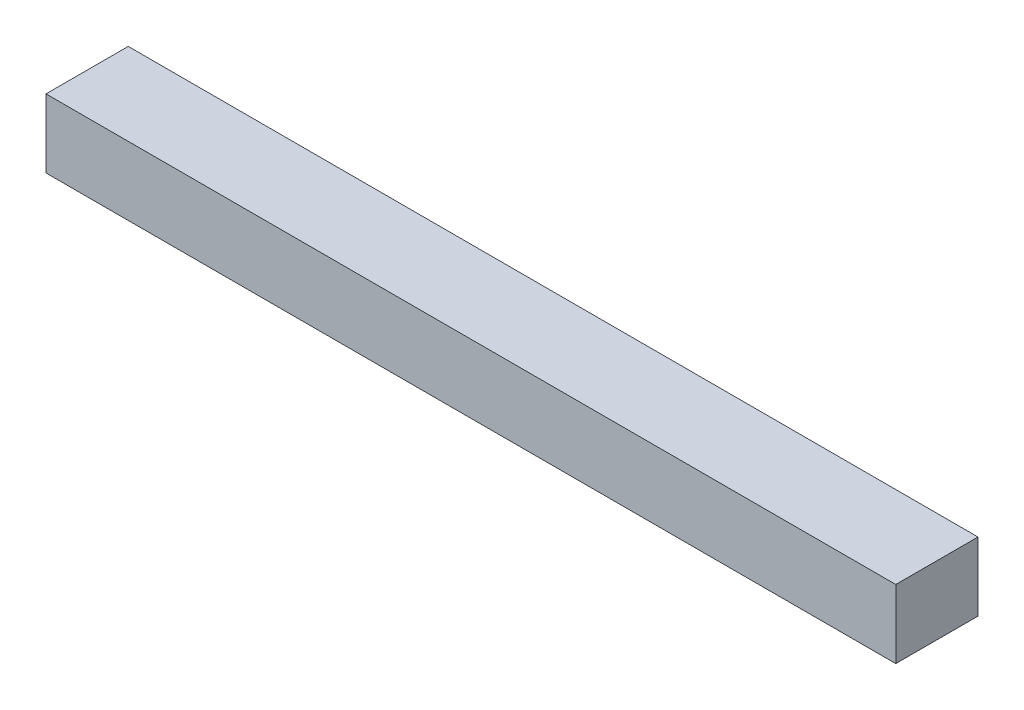
ISO-10303-21;
HEADER;
FILE_DESCRIPTION(('STEP AP214'),'2;1');
FILE_NAME('part.step','',(''),(''),'','','');
FILE_SCHEMA(('AUTOMOTIVE_DESIGN { 1 0 10303 214 1 1 1 1 }'));
ENDSEC;
DATA;
#1=APPLICATION_CONTEXT('core data for automotive mechanical design processes');
#2=APPLICATION_PROTOCOL_DEFINITION('international standard','automotive_design',2000,#1);
#3=PRODUCT_CONTEXT('',#1,'mechanical');
#4=PRODUCT('Part','Part','',(#3));
#5=PRODUCT_RELATED_PRODUCT_CATEGORY('part','',(#4));
#6=PRODUCT_DEFINITION_FORMATION('','',#4);
#7=PRODUCT_DEFINITION_CONTEXT('part definition',#1,'design');
#8=PRODUCT_DEFINITION('design','',#6,#7);
#9=PRODUCT_DEFINITION_SHAPE('','',#8);
#10=(LENGTH_UNIT() NAMED_UNIT(*) SI_UNIT(.MILLI.,.METRE.));
#11=(NAMED_UNIT(*) PLANE_ANGLE_UNIT() SI_UNIT($,.RADIAN.));
#12=(NAMED_UNIT(*) SI_UNIT($,.STERADIAN.) SOLID_ANGLE_UNIT());
#13=UNCERTAINTY_MEASURE_WITH_UNIT(LENGTH_MEASURE(1.E-05),#10,'distance_accuracy_value','');
#14=(GEOMETRIC_REPRESENTATION_CONTEXT(3) GLOBAL_UNCERTAINTY_ASSIGNED_CONTEXT((#13)) GLOBAL_UNIT_ASSIGNED_CONTEXT((#10,
#11,#12)) REPRESENTATION_CONTEXT('',''));
#15=CARTESIAN_POINT('',(0.,0.,0.));
#16=DIRECTION('',(0.,0.,1.));
#17=DIRECTION('',(1.,0.,0.));
#18=AXIS2_PLACEMENT_3D('',#15,#16,#17);
#19=CARTESIAN_POINT('',(310.,-12.5,-15.));
#20=DIRECTION('',(0.,0.,1.));
#21=DIRECTION('',(1.,0.,0.));
#22=AXIS2_PLACEMENT_3D('',#19,#20,#21);
#23=PLANE('',#22);
#24=DIRECTION('',(0.,1.,0.));
#25=VECTOR('',#24,1.);
#26=CARTESIAN_POINT('',(0.,-12.5,-15.));
#27=LINE('',#26,#25);
#28=CARTESIAN_POINT('',(0.,-12.5,-15.));
#29=VERTEX_POINT('',#28);
#30=CARTESIAN_POINT('',(0.,12.5,-15.));
#31=VERTEX_POINT('',#30);
#32=EDGE_CURVE('E100',#29,#31,#27,.T.);
#33=ORIENTED_EDGE('',*,*,#32,.T.);
#34=DIRECTION('',(-1.,0.,0.));
#35=VECTOR('',#34,1.);
#36=CARTESIAN_POINT('',(310.,12.5,-15.));
#37=LINE('',#36,#35);
#38=CARTESIAN_POINT('',(310.,12.5,-15.));
#39=VERTEX_POINT('',#38);
#40=EDGE_CURVE('E11',#39,#31,#37,.T.);
#41=ORIENTED_EDGE('',*,*,#40,.F.);
#42=DIRECTION('',(0.,1.,0.));
#43=VECTOR('',#42,1.);
#44=CARTESIAN_POINT('',(310.,-12.5,-15.));
#45=LINE('',#44,#43);
#46=CARTESIAN_POINT('',(310.,-12.5,-15.));
#47=VERTEX_POINT('',#46);
#48=EDGE_CURVE('E88',#47,#39,#45,.T.);
#49=ORIENTED_EDGE('',*,*,#48,.F.);
#50=DIRECTION('',(-1.,0.,0.));
#51=VECTOR('',#50,1.);
#52=CARTESIAN_POINT('',(310.,-12.5,-15.));
#53=LINE('',#52,#51);
#54=EDGE_CURVE('E96',#47,#29,#53,.T.);
#55=ORIENTED_EDGE('',*,*,#54,.T.);
#56=EDGE_LOOP('',(#33,#41,#49,#55));
#57=FACE_BOUND('',#56,.T.);
#58=ADVANCED_FACE('F37',(#57),#23,.F.);
#59=CARTESIAN_POINT('',(310.,12.5,15.));
#60=DIRECTION('',(0.,-1.,0.));
#61=DIRECTION('',(0.,0.,-1.));
#62=AXIS2_PLACEMENT_3D('',#59,#60,#61);
#63=PLANE('',#62);
#64=DIRECTION('',(0.,0.,1.));
#65=VECTOR('',#64,1.);
#66=CARTESIAN_POINT('',(0.,12.5,15.));
#67=LINE('',#66,#65);
#68=CARTESIAN_POINT('',(0.,12.5,15.));
#69=VERTEX_POINT('',#68);
#70=EDGE_CURVE('E92',#31,#69,#67,.T.);
#71=ORIENTED_EDGE('',*,*,#70,.T.);
#72=DIRECTION('',(-1.,0.,0.));
#73=VECTOR('',#72,1.);
#74=CARTESIAN_POINT('',(310.,12.5,15.));
#75=LINE('',#74,#73);
#76=CARTESIAN_POINT('',(310.,12.5,15.));
#77=VERTEX_POINT('',#76);
#78=EDGE_CURVE('E45',#77,#69,#75,.T.);
#79=ORIENTED_EDGE('',*,*,#78,.F.);
#80=DIRECTION('',(0.,0.,1.));
#81=VECTOR('',#80,1.);
#82=CARTESIAN_POINT('',(310.,12.5,15.));
#83=LINE('',#82,#81);
#84=EDGE_CURVE('E83',#39,#77,#83,.T.);
#85=ORIENTED_EDGE('',*,*,#84,.F.);
#86=ORIENTED_EDGE('',*,*,#40,.T.);
#87=EDGE_LOOP('',(#71,#79,#85,#86));
#88=FACE_BOUND('',#87,.T.);
#89=ADVANCED_FACE('F91',(#88),#63,.F.);
#90=CARTESIAN_POINT('',(310.,-12.5,15.));
#91=DIRECTION('',(0.,0.,-1.));
#92=DIRECTION('',(-1.,0.,0.));
#93=AXIS2_PLACEMENT_3D('',#90,#91,#92);
#94=PLANE('',#93);
#95=DIRECTION('',(0.,-1.,0.));
#96=VECTOR('',#95,1.);
#97=CARTESIAN_POINT('',(0.,-12.5,15.));
#98=LINE('',#97,#96);
#99=CARTESIAN_POINT('',(0.,-12.5,15.));
#100=VERTEX_POINT('',#99);
#101=EDGE_CURVE('E70',#69,#100,#98,.T.);
#102=ORIENTED_EDGE('',*,*,#101,.T.);
#103=DIRECTION('',(-1.,0.,0.));
#104=VECTOR('',#103,1.);
#105=CARTESIAN_POINT('',(310.,-12.5,15.));
#106=LINE('',#105,#104);
#107=CARTESIAN_POINT('',(310.,-12.5,15.));
#108=VERTEX_POINT('',#107);
#109=EDGE_CURVE('E93',#108,#100,#106,.T.);
#110=ORIENTED_EDGE('',*,*,#109,.F.);
#111=DIRECTION('',(0.,-1.,0.));
#112=VECTOR('',#111,1.);
#113=CARTESIAN_POINT('',(310.,-12.5,15.));
#114=LINE('',#113,#112);
#115=EDGE_CURVE('E86',#77,#108,#114,.T.);
#116=ORIENTED_EDGE('',*,*,#115,.F.);
#117=ORIENTED_EDGE('',*,*,#78,.T.);
#118=EDGE_LOOP('',(#102,#110,#116,#117));
#119=FACE_BOUND('',#118,.T.);
#120=ADVANCED_FACE('F94',(#119),#94,.F.);
#121=CARTESIAN_POINT('',(310.,-12.5,15.));
#122=DIRECTION('',(0.,1.,0.));
#123=DIRECTION('',(0.,0.,1.));
#124=AXIS2_PLACEMENT_3D('',#121,#122,#123);
#125=PLANE('',#124);
#126=DIRECTION('',(0.,0.,-1.));
#127=VECTOR('',#126,1.);
#128=CARTESIAN_POINT('',(0.,-12.5,15.));
#129=LINE('',#128,#127);
#130=EDGE_CURVE('E76',#100,#29,#129,.T.);
#131=ORIENTED_EDGE('',*,*,#130,.T.);
#132=ORIENTED_EDGE('',*,*,#54,.F.);
#133=DIRECTION('',(0.,0.,-1.));
#134=VECTOR('',#133,1.);
#135=CARTESIAN_POINT('',(310.,-12.5,15.));
#136=LINE('',#135,#134);
#137=EDGE_CURVE('E53',#108,#47,#136,.T.);
#138=ORIENTED_EDGE('',*,*,#137,.F.);
#139=ORIENTED_EDGE('',*,*,#109,.T.);
#140=EDGE_LOOP('',(#131,#132,#138,#139));
#141=FACE_BOUND('',#140,.T.);
#142=ADVANCED_FACE('F107',(#141),#125,.F.);
#143=CARTESIAN_POINT('',(310.,0.,0.));
#144=DIRECTION('',(-1.,0.,0.));
#145=DIRECTION('',(0.,0.,1.));
#146=AXIS2_PLACEMENT_3D('',#143,#144,#145);
#147=PLANE('',#146);
#148=ORIENTED_EDGE('',*,*,#48,.T.);
#149=ORIENTED_EDGE('',*,*,#84,.T.);
#150=ORIENTED_EDGE('',*,*,#115,.T.);
#151=ORIENTED_EDGE('',*,*,#137,.T.);
#152=EDGE_LOOP('',(#148,#149,#150,#151));
#153=FACE_BOUND('',#152,.T.);
#154=ADVANCED_FACE('F84',(#153),#147,.F.);
#155=CARTESIAN_POINT('',(0.,0.,0.));
#156=DIRECTION('',(-1.,0.,0.));
#157=DIRECTION('',(0.,0.,1.));
#158=AXIS2_PLACEMENT_3D('',#155,#156,#157);
#159=PLANE('',#158);
#160=ORIENTED_EDGE('',*,*,#32,.F.);
#161=ORIENTED_EDGE('',*,*,#130,.F.);
#162=ORIENTED_EDGE('',*,*,#101,.F.);
#163=ORIENTED_EDGE('',*,*,#70,.F.);
#164=EDGE_LOOP('',(#160,#161,#162,#163));
#165=FACE_BOUND('',#164,.T.);
#166=ADVANCED_FACE('F110',(#165),#159,.T.);
#167=CLOSED_SHELL('',(#58,#89,#120,#142,#154,#166));
#168=MANIFOLD_SOLID_BREP('B2',#167);
#169=ADVANCED_BREP_SHAPE_REPRESENTATION('',(#18,#168),#14);
#170=SHAPE_DEFINITION_REPRESENTATION(#9,#169);
ENDSEC;
END-ISO-10303-21;
